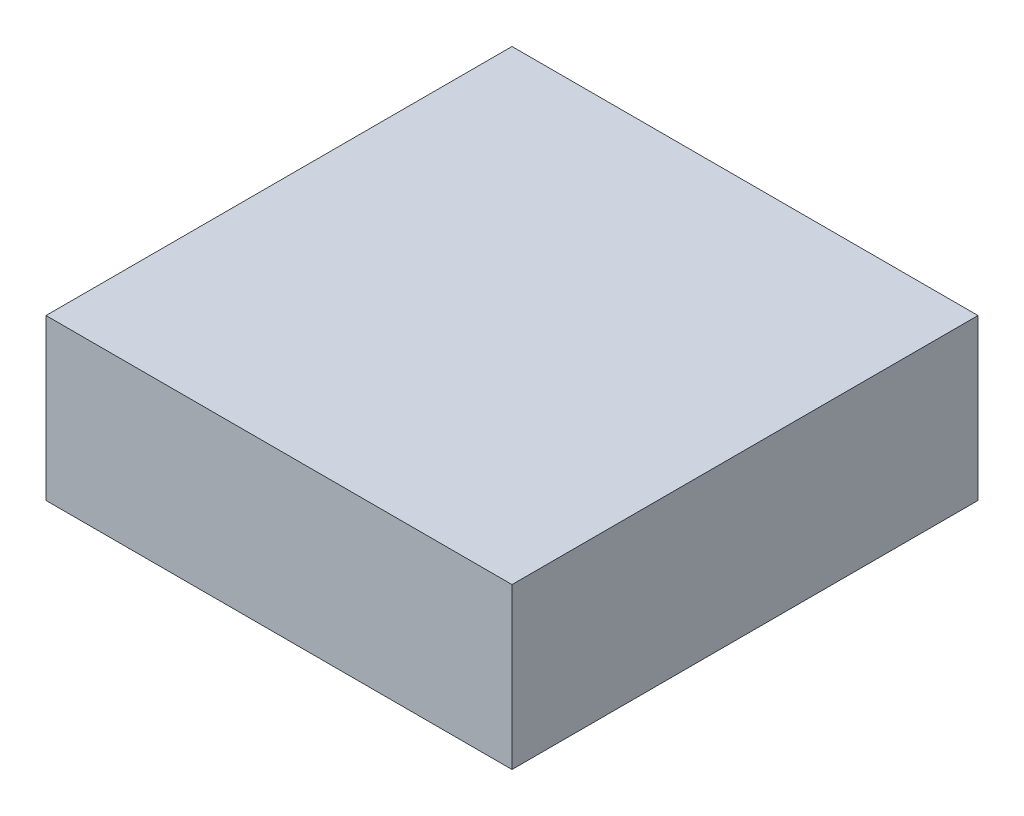
ISO-10303-21;
HEADER;
FILE_DESCRIPTION(('STEP AP214'),'2;1');
FILE_NAME('part.step','',(''),(''),'','','');
FILE_SCHEMA(('AUTOMOTIVE_DESIGN { 1 0 10303 214 1 1 1 1 }'));
ENDSEC;
DATA;
#1=APPLICATION_CONTEXT('core data for automotive mechanical design processes');
#2=APPLICATION_PROTOCOL_DEFINITION('international standard','automotive_design',2000,#1);
#3=PRODUCT_CONTEXT('',#1,'mechanical');
#4=PRODUCT('Part','Part','',(#3));
#5=PRODUCT_RELATED_PRODUCT_CATEGORY('part','',(#4));
#6=PRODUCT_DEFINITION_FORMATION('','',#4);
#7=PRODUCT_DEFINITION_CONTEXT('part definition',#1,'design');
#8=PRODUCT_DEFINITION('design','',#6,#7);
#9=PRODUCT_DEFINITION_SHAPE('','',#8);
#10=(LENGTH_UNIT() NAMED_UNIT(*) SI_UNIT(.MILLI.,.METRE.));
#11=(NAMED_UNIT(*) PLANE_ANGLE_UNIT() SI_UNIT($,.RADIAN.));
#12=(NAMED_UNIT(*) SI_UNIT($,.STERADIAN.) SOLID_ANGLE_UNIT());
#13=UNCERTAINTY_MEASURE_WITH_UNIT(LENGTH_MEASURE(1.E-05),#10,'distance_accuracy_value','');
#14=(GEOMETRIC_REPRESENTATION_CONTEXT(3) GLOBAL_UNCERTAINTY_ASSIGNED_CONTEXT((#13)) GLOBAL_UNIT_ASSIGNED_CONTEXT((#10,
#11,#12)) REPRESENTATION_CONTEXT('',''));
#15=CARTESIAN_POINT('',(0.,0.,0.));
#16=DIRECTION('',(0.,0.,1.));
#17=DIRECTION('',(1.,0.,0.));
#18=AXIS2_PLACEMENT_3D('',#15,#16,#17);
#19=CARTESIAN_POINT('',(-19.9596626410732,3.1481690140845,32.));
#20=DIRECTION('',(-0.42156835373353,0.906796627216049,0.));
#21=DIRECTION('',(-0.906796627216048,-0.42156835373353,0.));
#22=AXIS2_PLACEMENT_3D('',#19,#20,#21);
#23=PLANE('',#22);
#24=DIRECTION('',(0.671741727957964,0.312291693517609,0.671741727957964));
#25=VECTOR('',#24,1.);
#26=CARTESIAN_POINT('',(-19.9596626410732,3.1481690140845,32.));
#27=LINE('',#26,#25);
#28=CARTESIAN_POINT('',(-35.9596626410732,-4.29020631428936,16.));
#29=VERTEX_POINT('',#28);
#30=CARTESIAN_POINT('',(-19.9596626410732,3.1481690140845,32.));
#31=VERTEX_POINT('',#30);
#32=EDGE_CURVE('E92',#29,#31,#27,.T.);
#33=ORIENTED_EDGE('',*,*,#32,.F.);
#34=DIRECTION('',(-0.671741727957964,-0.312291693517609,0.671741727957964));
#35=VECTOR('',#34,1.);
#36=CARTESIAN_POINT('',(-34.3992450116317,-3.56477056448951,14.4395823705585));
#37=LINE('',#36,#35);
#38=CARTESIAN_POINT('',(-19.9596626410732,3.1481690140845,0.));
#39=VERTEX_POINT('',#38);
#40=EDGE_CURVE('E96',#39,#29,#37,.T.);
#41=ORIENTED_EDGE('',*,*,#40,.F.);
#42=DIRECTION('',(0.,0.,-1.));
#43=VECTOR('',#42,1.);
#44=CARTESIAN_POINT('',(-19.9596626410732,3.1481690140845,32.));
#45=LINE('',#44,#43);
#46=EDGE_CURVE('E102',#31,#39,#45,.T.);
#47=ORIENTED_EDGE('',*,*,#46,.F.);
#48=EDGE_LOOP('',(#33,#41,#47));
#49=FACE_BOUND('',#48,.T.);
#50=CARTESIAN_POINT('',(-23.5868491499374,1.46189559915038,16.));
#51=DIRECTION('',(-0.42156835373353,0.906796627216049,0.));
#52=DIRECTION('',(-0.906796627216048,-0.42156835373353,0.));
#53=AXIS2_PLACEMENT_3D('',#50,#51,#52);
#54=CIRCLE('',#53,1.);
#55=CARTESIAN_POINT('',(-24.4936457771535,1.04032724541685,16.));
#56=VERTEX_POINT('',#55);
#57=EDGE_CURVE('E11',#56,#56,#54,.F.);
#58=ORIENTED_EDGE('',*,*,#57,.F.);
#59=EDGE_LOOP('',(#58));
#60=FACE_BOUND('',#59,.T.);
#61=ADVANCED_FACE('F33',(#49,#60),#23,.F.);
#62=CARTESIAN_POINT('',(-35.9596626410732,-4.29020631428936,32.));
#63=DIRECTION('',(0.42156835373353,0.906796627216049,0.));
#64=DIRECTION('',(-0.906796627216049,0.42156835373353,0.));
#65=AXIS2_PLACEMENT_3D('',#62,#63,#64);
#66=PLANE('',#65);
#67=DIRECTION('',(0.671741727957964,-0.312291693517609,-0.671741727957964));
#68=VECTOR('',#67,1.);
#69=CARTESIAN_POINT('',(-43.1794538263524,-0.933736525002352,23.2197911852792));
#70=LINE('',#69,#68);
#71=CARTESIAN_POINT('',(-51.9596626410732,3.1481690140845,32.));
#72=VERTEX_POINT('',#71);
#73=EDGE_CURVE('E89',#72,#29,#70,.T.);
#74=ORIENTED_EDGE('',*,*,#73,.F.);
#75=DIRECTION('',(0.,0.,-1.));
#76=VECTOR('',#75,1.);
#77=CARTESIAN_POINT('',(-51.9596626410732,3.1481690140845,32.));
#78=LINE('',#77,#76);
#79=CARTESIAN_POINT('',(-51.9596626410732,3.1481690140845,0.));
#80=VERTEX_POINT('',#79);
#81=EDGE_CURVE('E107',#72,#80,#78,.T.);
#82=ORIENTED_EDGE('',*,*,#81,.T.);
#83=DIRECTION('',(-0.671741727957964,0.312291693517609,-0.671741727957964));
#84=VECTOR('',#83,1.);
#85=CARTESIAN_POINT('',(-28.739871455794,-7.64667610357636,23.2197911852792));
#86=LINE('',#85,#84);
#87=EDGE_CURVE('E66',#29,#80,#86,.T.);
#88=ORIENTED_EDGE('',*,*,#87,.F.);
#89=EDGE_LOOP('',(#74,#82,#88));
#90=FACE_BOUND('',#89,.T.);
#91=ADVANCED_FACE('F106',(#90),#66,.F.);
#92=CARTESIAN_POINT('',(0.,0.,32.));
#93=DIRECTION('',(0.,0.,-1.));
#94=DIRECTION('',(-1.,0.,0.));
#95=AXIS2_PLACEMENT_3D('',#92,#93,#94);
#96=PLANE('',#95);
#97=DIRECTION('',(1.,0.,0.));
#98=VECTOR('',#97,1.);
#99=CARTESIAN_POINT('',(-52.9596626410732,3.1481690140845,32.));
#100=LINE('',#99,#98);
#101=EDGE_CURVE('E93',#72,#31,#100,.T.);
#102=ORIENTED_EDGE('',*,*,#101,.T.);
#103=DIRECTION('',(0.,1.,0.));
#104=VECTOR('',#103,1.);
#105=CARTESIAN_POINT('',(-19.9596626410732,14.1481690140845,32.));
#106=LINE('',#105,#104);
#107=CARTESIAN_POINT('',(-19.9596626410732,14.1481690140845,32.));
#108=VERTEX_POINT('',#107);
#109=EDGE_CURVE('E50',#31,#108,#106,.T.);
#110=ORIENTED_EDGE('',*,*,#109,.T.);
#111=DIRECTION('',(-1.,0.,0.));
#112=VECTOR('',#111,1.);
#113=CARTESIAN_POINT('',(-51.9596626410732,14.1481690140845,32.));
#114=LINE('',#113,#112);
#115=CARTESIAN_POINT('',(-51.9596626410732,14.1481690140845,32.));
#116=VERTEX_POINT('',#115);
#117=EDGE_CURVE('E114',#108,#116,#114,.T.);
#118=ORIENTED_EDGE('',*,*,#117,.T.);
#119=DIRECTION('',(0.,-1.,0.));
#120=VECTOR('',#119,1.);
#121=CARTESIAN_POINT('',(-51.9596626410732,14.1481690140845,32.));
#122=LINE('',#121,#120);
#123=EDGE_CURVE('E79',#116,#72,#122,.T.);
#124=ORIENTED_EDGE('',*,*,#123,.T.);
#125=EDGE_LOOP('',(#102,#110,#118,#124));
#126=FACE_BOUND('',#125,.T.);
#127=ADVANCED_FACE('F149',(#126),#96,.F.);
#128=CARTESIAN_POINT('',(0.,0.,0.));
#129=DIRECTION('',(0.,0.,-1.));
#130=DIRECTION('',(-1.,0.,0.));
#131=AXIS2_PLACEMENT_3D('',#128,#129,#130);
#132=PLANE('',#131);
#133=DIRECTION('',(0.,1.,0.));
#134=VECTOR('',#133,1.);
#135=CARTESIAN_POINT('',(-19.9596626410732,14.1481690140845,0.));
#136=LINE('',#135,#134);
#137=CARTESIAN_POINT('',(-19.9596626410732,14.1481690140845,0.));
#138=VERTEX_POINT('',#137);
#139=EDGE_CURVE('E72',#39,#138,#136,.T.);
#140=ORIENTED_EDGE('',*,*,#139,.F.);
#141=DIRECTION('',(-1.,0.,0.));
#142=VECTOR('',#141,1.);
#143=CARTESIAN_POINT('',(0.,3.1481690140845,0.));
#144=LINE('',#143,#142);
#145=EDGE_CURVE('E42',#39,#80,#144,.T.);
#146=ORIENTED_EDGE('',*,*,#145,.T.);
#147=DIRECTION('',(0.,-1.,0.));
#148=VECTOR('',#147,1.);
#149=CARTESIAN_POINT('',(-51.9596626410732,14.1481690140845,0.));
#150=LINE('',#149,#148);
#151=CARTESIAN_POINT('',(-51.9596626410732,14.1481690140845,0.));
#152=VERTEX_POINT('',#151);
#153=EDGE_CURVE('E111',#152,#80,#150,.T.);
#154=ORIENTED_EDGE('',*,*,#153,.F.);
#155=DIRECTION('',(-1.,0.,0.));
#156=VECTOR('',#155,1.);
#157=CARTESIAN_POINT('',(-51.9596626410732,14.1481690140845,0.));
#158=LINE('',#157,#156);
#159=EDGE_CURVE('E108',#138,#152,#158,.T.);
#160=ORIENTED_EDGE('',*,*,#159,.F.);
#161=EDGE_LOOP('',(#140,#146,#154,#160));
#162=FACE_BOUND('',#161,.T.);
#163=ADVANCED_FACE('F127',(#162),#132,.T.);
#164=CARTESIAN_POINT('',(-51.9596626410732,14.1481690140845,32.));
#165=DIRECTION('',(0.,-1.,0.));
#166=DIRECTION('',(0.,0.,-1.));
#167=AXIS2_PLACEMENT_3D('',#164,#165,#166);
#168=PLANE('',#167);
#169=ORIENTED_EDGE('',*,*,#159,.T.);
#170=DIRECTION('',(0.,0.,-1.));
#171=VECTOR('',#170,1.);
#172=CARTESIAN_POINT('',(-51.9596626410732,14.1481690140845,32.));
#173=LINE('',#172,#171);
#174=EDGE_CURVE('E125',#116,#152,#173,.T.);
#175=ORIENTED_EDGE('',*,*,#174,.F.);
#176=ORIENTED_EDGE('',*,*,#117,.F.);
#177=DIRECTION('',(0.,0.,-1.));
#178=VECTOR('',#177,1.);
#179=CARTESIAN_POINT('',(-19.9596626410732,14.1481690140845,32.));
#180=LINE('',#179,#178);
#181=EDGE_CURVE('E117',#108,#138,#180,.T.);
#182=ORIENTED_EDGE('',*,*,#181,.T.);
#183=EDGE_LOOP('',(#169,#175,#176,#182));
#184=FACE_BOUND('',#183,.T.);
#185=ADVANCED_FACE('F35',(#184),#168,.F.);
#186=CARTESIAN_POINT('',(-51.9596626410732,14.1481690140845,32.));
#187=DIRECTION('',(1.,0.,0.));
#188=DIRECTION('',(0.,1.,0.));
#189=AXIS2_PLACEMENT_3D('',#186,#187,#188);
#190=PLANE('',#189);
#191=ORIENTED_EDGE('',*,*,#153,.T.);
#192=ORIENTED_EDGE('',*,*,#81,.F.);
#193=ORIENTED_EDGE('',*,*,#123,.F.);
#194=ORIENTED_EDGE('',*,*,#174,.T.);
#195=EDGE_LOOP('',(#191,#192,#193,#194));
#196=FACE_BOUND('',#195,.T.);
#197=ADVANCED_FACE('F129',(#196),#190,.F.);
#198=CARTESIAN_POINT('',(-19.9596626410732,14.1481690140845,32.));
#199=DIRECTION('',(-1.,0.,0.));
#200=DIRECTION('',(0.,0.,1.));
#201=AXIS2_PLACEMENT_3D('',#198,#199,#200);
#202=PLANE('',#201);
#203=ORIENTED_EDGE('',*,*,#139,.T.);
#204=ORIENTED_EDGE('',*,*,#181,.F.);
#205=ORIENTED_EDGE('',*,*,#109,.F.);
#206=ORIENTED_EDGE('',*,*,#46,.T.);
#207=EDGE_LOOP('',(#203,#204,#205,#206));
#208=FACE_BOUND('',#207,.T.);
#209=ADVANCED_FACE('F133',(#208),#202,.F.);
#210=CARTESIAN_POINT('',(-52.9596626410732,2.58867680453672,1.20347185474998));
#211=DIRECTION('',(0.,-0.906796627216048,-0.42156835373353));
#212=DIRECTION('',(0.,0.42156835373353,-0.906796627216049));
#213=AXIS2_PLACEMENT_3D('',#210,#211,#212);
#214=PLANE('',#213);
#215=ORIENTED_EDGE('',*,*,#87,.T.);
#216=ORIENTED_EDGE('',*,*,#145,.F.);
#217=ORIENTED_EDGE('',*,*,#40,.T.);
#218=EDGE_LOOP('',(#215,#216,#217));
#219=FACE_BOUND('',#218,.T.);
#220=ADVANCED_FACE('F104',(#219),#214,.T.);
#221=CARTESIAN_POINT('',(-52.9596626410732,-9.64417955727407,4.48356420507719));
#222=DIRECTION('',(0.,-0.906796627216048,0.42156835373353));
#223=DIRECTION('',(0.,-0.42156835373353,-0.906796627216049));
#224=AXIS2_PLACEMENT_3D('',#221,#222,#223);
#225=PLANE('',#224);
#226=ORIENTED_EDGE('',*,*,#73,.T.);
#227=ORIENTED_EDGE('',*,*,#32,.T.);
#228=ORIENTED_EDGE('',*,*,#101,.F.);
#229=EDGE_LOOP('',(#226,#227,#228));
#230=FACE_BOUND('',#229,.T.);
#231=ADVANCED_FACE('F91',(#230),#225,.T.);
#232=CARTESIAN_POINT('',(-23.5847413081687,1.4573616160143,16.));
#233=DIRECTION('',(-0.42156835373353,0.906796627216048,0.));
#234=DIRECTION('',(-0.906796627216048,-0.42156835373353,0.));
#235=AXIS2_PLACEMENT_3D('',#232,#233,#234);
#236=CYLINDRICAL_SURFACE('',#235,1.);
#237=CARTESIAN_POINT('',(-23.5847413081687,1.4573616160143,16.));
#238=DIRECTION('',(0.42156835373353,-0.906796627216048,0.));
#239=DIRECTION('',(0.906796627216048,0.42156835373353,0.));
#240=AXIS2_PLACEMENT_3D('',#237,#238,#239);
#241=CIRCLE('',#240,1.);
#242=CARTESIAN_POINT('',(-22.6779446809527,1.87892996974783,16.));
#243=VERTEX_POINT('',#242);
#244=EDGE_CURVE('E172',#243,#243,#241,.T.);
#245=ORIENTED_EDGE('',*,*,#244,.F.);
#246=EDGE_LOOP('',(#245));
#247=FACE_BOUND('',#246,.T.);
#248=ORIENTED_EDGE('',*,*,#57,.T.);
#249=EDGE_LOOP('',(#248));
#250=FACE_BOUND('',#249,.T.);
#251=ADVANCED_FACE('F161',(#247,#250),#236,.T.);
#252=CARTESIAN_POINT('',(-23.5847413081687,1.4573616160143,16.));
#253=DIRECTION('',(0.42156835373353,-0.906796627216048,0.));
#254=DIRECTION('',(0.906796627216048,0.42156835373353,0.));
#255=AXIS2_PLACEMENT_3D('',#252,#253,#254);
#256=PLANE('',#255);
#257=ORIENTED_EDGE('',*,*,#244,.T.);
#258=EDGE_LOOP('',(#257));
#259=FACE_BOUND('',#258,.T.);
#260=ADVANCED_FACE('F164',(#259),#256,.T.);
#261=CLOSED_SHELL('',(#61,#91,#127,#163,#185,#197,#209,#220,#231,#251,#260));
#262=MANIFOLD_SOLID_BREP('B2',#261);
#263=ADVANCED_BREP_SHAPE_REPRESENTATION('',(#18,#262),#14);
#264=SHAPE_DEFINITION_REPRESENTATION(#9,#263);
ENDSEC;
END-ISO-10303-21;
